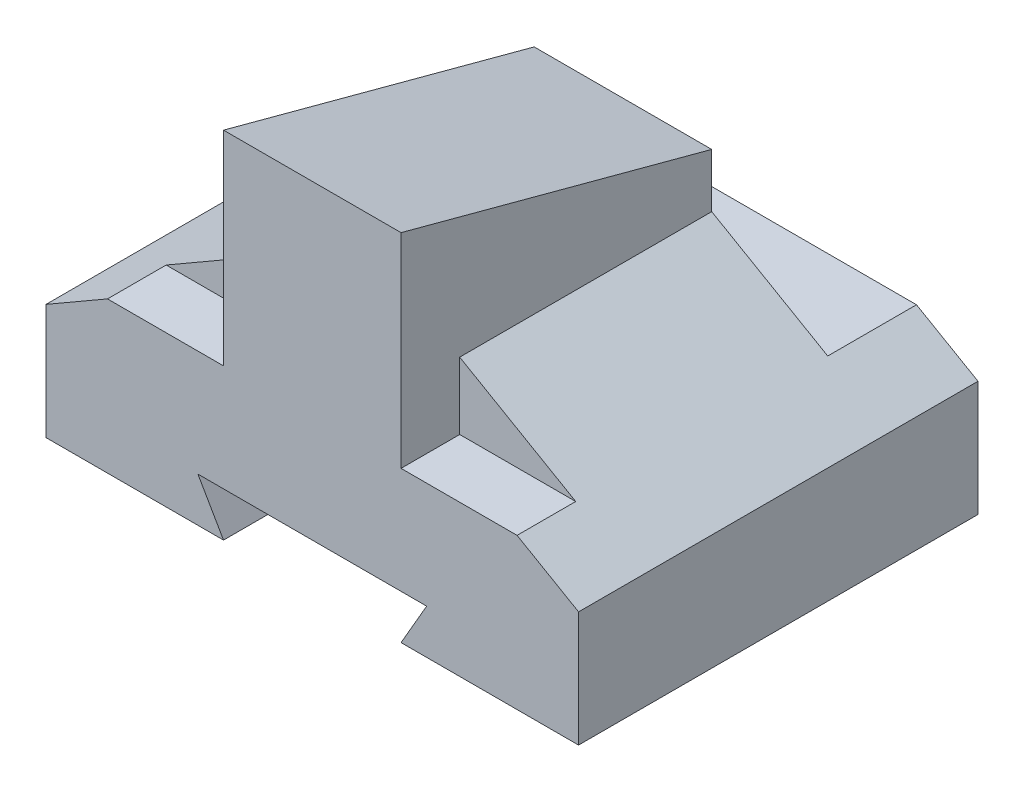
ISO-10303-21;
HEADER;
FILE_DESCRIPTION(('STEP AP214'),'2;1');
FILE_NAME('part.step','',(''),(''),'','','');
FILE_SCHEMA(('AUTOMOTIVE_DESIGN { 1 0 10303 214 1 1 1 1 }'));
ENDSEC;
DATA;
#1=APPLICATION_CONTEXT('core data for automotive mechanical design processes');
#2=APPLICATION_PROTOCOL_DEFINITION('international standard','automotive_design',2000,#1);
#3=PRODUCT_CONTEXT('',#1,'mechanical');
#4=PRODUCT('Part','Part','',(#3));
#5=PRODUCT_RELATED_PRODUCT_CATEGORY('part','',(#4));
#6=PRODUCT_DEFINITION_FORMATION('','',#4);
#7=PRODUCT_DEFINITION_CONTEXT('part definition',#1,'design');
#8=PRODUCT_DEFINITION('design','',#6,#7);
#9=PRODUCT_DEFINITION_SHAPE('','',#8);
#10=(LENGTH_UNIT() NAMED_UNIT(*) SI_UNIT(.MILLI.,.METRE.));
#11=(NAMED_UNIT(*) PLANE_ANGLE_UNIT() SI_UNIT($,.RADIAN.));
#12=(NAMED_UNIT(*) SI_UNIT($,.STERADIAN.) SOLID_ANGLE_UNIT());
#13=UNCERTAINTY_MEASURE_WITH_UNIT(LENGTH_MEASURE(1.E-05),#10,'distance_accuracy_value','');
#14=(GEOMETRIC_REPRESENTATION_CONTEXT(3) GLOBAL_UNCERTAINTY_ASSIGNED_CONTEXT((#13)) GLOBAL_UNIT_ASSIGNED_CONTEXT((#10,
#11,#12)) REPRESENTATION_CONTEXT('',''));
#15=CARTESIAN_POINT('',(0.,0.,0.));
#16=DIRECTION('',(0.,0.,1.));
#17=DIRECTION('',(1.,0.,0.));
#18=AXIS2_PLACEMENT_3D('',#15,#16,#17);
#19=CARTESIAN_POINT('',(30.,13.,22.5));
#20=DIRECTION('',(0.,0.,-1.));
#21=DIRECTION('',(-1.,0.,0.));
#22=AXIS2_PLACEMENT_3D('',#19,#20,#21);
#23=PLANE('',#22);
#24=DIRECTION('',(0.500000000000005,-0.866025403784436,0.));
#25=VECTOR('',#24,1.);
#26=CARTESIAN_POINT('',(-7.49999999999995,-4.33012701892222,22.5));
#27=LINE('',#26,#25);
#28=CARTESIAN_POINT('',(-12.8867513459482,5.,22.5));
#29=VERTEX_POINT('',#28);
#30=CARTESIAN_POINT('',(-9.99999999999999,0.,22.5));
#31=VERTEX_POINT('',#30);
#32=EDGE_CURVE('E482',#29,#31,#27,.T.);
#33=ORIENTED_EDGE('',*,*,#32,.F.);
#34=DIRECTION('',(-1.,0.,0.));
#35=VECTOR('',#34,1.);
#36=CARTESIAN_POINT('',(0.,5.,22.5));
#37=LINE('',#36,#35);
#38=CARTESIAN_POINT('',(12.8867513459481,5.,22.5));
#39=VERTEX_POINT('',#38);
#40=EDGE_CURVE('E476',#39,#29,#37,.T.);
#41=ORIENTED_EDGE('',*,*,#40,.F.);
#42=DIRECTION('',(0.499999999999997,0.86602540378444,0.));
#43=VECTOR('',#42,1.);
#44=CARTESIAN_POINT('',(7.50000000000003,-4.33012701892218,22.5));
#45=LINE('',#44,#43);
#46=CARTESIAN_POINT('',(10.,0.,22.5));
#47=VERTEX_POINT('',#46);
#48=EDGE_CURVE('E471',#47,#39,#45,.T.);
#49=ORIENTED_EDGE('',*,*,#48,.F.);
#50=DIRECTION('',(1.,0.,0.));
#51=VECTOR('',#50,1.);
#52=CARTESIAN_POINT('',(30.,0.,22.5));
#53=LINE('',#52,#51);
#54=CARTESIAN_POINT('',(30.,0.,22.5));
#55=VERTEX_POINT('',#54);
#56=EDGE_CURVE('E255',#47,#55,#53,.T.);
#57=ORIENTED_EDGE('',*,*,#56,.T.);
#58=DIRECTION('',(0.,-1.,0.));
#59=VECTOR('',#58,1.);
#60=CARTESIAN_POINT('',(30.,13.,22.5));
#61=LINE('',#60,#59);
#62=CARTESIAN_POINT('',(30.,13.,22.5));
#63=VERTEX_POINT('',#62);
#64=EDGE_CURVE('E274',#63,#55,#61,.T.);
#65=ORIENTED_EDGE('',*,*,#64,.F.);
#66=DIRECTION('',(0.86602540378444,-0.499999999999998,0.));
#67=VECTOR('',#66,1.);
#68=CARTESIAN_POINT('',(13.1291651245988,22.7403810567666,22.5));
#69=LINE('',#68,#67);
#70=CARTESIAN_POINT('',(23.0717967697244,17.,22.5));
#71=VERTEX_POINT('',#70);
#72=EDGE_CURVE('E228',#71,#63,#69,.T.);
#73=ORIENTED_EDGE('',*,*,#72,.F.);
#74=DIRECTION('',(-1.,0.,0.));
#75=VECTOR('',#74,1.);
#76=CARTESIAN_POINT('',(30.,17.,22.5));
#77=LINE('',#76,#75);
#78=CARTESIAN_POINT('',(10.,17.,22.5));
#79=VERTEX_POINT('',#78);
#80=EDGE_CURVE('E197',#71,#79,#77,.T.);
#81=ORIENTED_EDGE('',*,*,#80,.T.);
#82=DIRECTION('',(0.,1.,0.));
#83=VECTOR('',#82,1.);
#84=CARTESIAN_POINT('',(10.,-0.002000000000002,22.5));
#85=LINE('',#84,#83);
#86=CARTESIAN_POINT('',(10.,40.,22.5));
#87=VERTEX_POINT('',#86);
#88=EDGE_CURVE('E97',#79,#87,#85,.T.);
#89=ORIENTED_EDGE('',*,*,#88,.T.);
#90=DIRECTION('',(-1.,0.,0.));
#91=VECTOR('',#90,1.);
#92=CARTESIAN_POINT('',(-10.,40.,22.5));
#93=LINE('',#92,#91);
#94=CARTESIAN_POINT('',(-10.,40.,22.5));
#95=VERTEX_POINT('',#94);
#96=EDGE_CURVE('E300',#87,#95,#93,.T.);
#97=ORIENTED_EDGE('',*,*,#96,.T.);
#98=DIRECTION('',(0.,1.,0.));
#99=VECTOR('',#98,1.);
#100=CARTESIAN_POINT('',(-10.,-0.002000000000002,22.5));
#101=LINE('',#100,#99);
#102=CARTESIAN_POINT('',(-10.,17.,22.5));
#103=VERTEX_POINT('',#102);
#104=EDGE_CURVE('E316',#103,#95,#101,.T.);
#105=ORIENTED_EDGE('',*,*,#104,.F.);
#106=CARTESIAN_POINT('',(-23.0717967697246,17.,22.5));
#107=VERTEX_POINT('',#106);
#108=EDGE_CURVE('E201',#103,#107,#77,.T.);
#109=ORIENTED_EDGE('',*,*,#108,.T.);
#110=DIRECTION('',(0.866025403784436,0.500000000000004,0.));
#111=VECTOR('',#110,1.);
#112=CARTESIAN_POINT('',(-13.129165124599,22.7403810567666,22.5));
#113=LINE('',#112,#111);
#114=CARTESIAN_POINT('',(-30.,13.,22.5));
#115=VERTEX_POINT('',#114);
#116=EDGE_CURVE('E233',#115,#107,#113,.T.);
#117=ORIENTED_EDGE('',*,*,#116,.F.);
#118=DIRECTION('',(0.,-1.,0.));
#119=VECTOR('',#118,1.);
#120=CARTESIAN_POINT('',(-30.,13.,22.5));
#121=LINE('',#120,#119);
#122=CARTESIAN_POINT('',(-30.,0.,22.5));
#123=VERTEX_POINT('',#122);
#124=EDGE_CURVE('E278',#115,#123,#121,.T.);
#125=ORIENTED_EDGE('',*,*,#124,.T.);
#126=EDGE_CURVE('E256',#123,#31,#53,.T.);
#127=ORIENTED_EDGE('',*,*,#126,.T.);
#128=EDGE_LOOP('',(#33,#41,#49,#57,#65,#73,#81,#89,#97,#105,#109,#117,#125,#127));
#129=FACE_BOUND('',#128,.T.);
#130=ADVANCED_FACE('F44',(#129),#23,.F.);
#131=CARTESIAN_POINT('',(30.,13.,-22.5));
#132=DIRECTION('',(0.,0.,1.));
#133=DIRECTION('',(1.,0.,0.));
#134=AXIS2_PLACEMENT_3D('',#131,#132,#133);
#135=PLANE('',#134);
#136=DIRECTION('',(0.500000000000005,-0.866025403784436,0.));
#137=VECTOR('',#136,1.);
#138=CARTESIAN_POINT('',(-7.49999999999996,-4.33012701892222,-22.5));
#139=LINE('',#138,#137);
#140=CARTESIAN_POINT('',(-12.8867513459482,5.,-22.5));
#141=VERTEX_POINT('',#140);
#142=CARTESIAN_POINT('',(-10.,0.,-22.5));
#143=VERTEX_POINT('',#142);
#144=EDGE_CURVE('E389',#141,#143,#139,.T.);
#145=ORIENTED_EDGE('',*,*,#144,.T.);
#146=DIRECTION('',(-1.,0.,0.));
#147=VECTOR('',#146,1.);
#148=CARTESIAN_POINT('',(30.,0.,-22.5));
#149=LINE('',#148,#147);
#150=CARTESIAN_POINT('',(-30.,0.,-22.5));
#151=VERTEX_POINT('',#150);
#152=EDGE_CURVE('E263',#143,#151,#149,.T.);
#153=ORIENTED_EDGE('',*,*,#152,.T.);
#154=DIRECTION('',(0.,-1.,0.));
#155=VECTOR('',#154,1.);
#156=CARTESIAN_POINT('',(-30.,13.,-22.5));
#157=LINE('',#156,#155);
#158=CARTESIAN_POINT('',(-30.,13.,-22.5));
#159=VERTEX_POINT('',#158);
#160=EDGE_CURVE('E251',#159,#151,#157,.T.);
#161=ORIENTED_EDGE('',*,*,#160,.F.);
#162=DIRECTION('',(0.866025403784436,0.500000000000004,0.));
#163=VECTOR('',#162,1.);
#164=CARTESIAN_POINT('',(-13.129165124599,22.7403810567666,-22.5));
#165=LINE('',#164,#163);
#166=CARTESIAN_POINT('',(-23.0717967697246,17.,-22.5));
#167=VERTEX_POINT('',#166);
#168=EDGE_CURVE('E232',#159,#167,#165,.T.);
#169=ORIENTED_EDGE('',*,*,#168,.T.);
#170=DIRECTION('',(1.,0.,0.));
#171=VECTOR('',#170,1.);
#172=CARTESIAN_POINT('',(-30.,17.,-22.5));
#173=LINE('',#172,#171);
#174=CARTESIAN_POINT('',(23.0717967697244,17.,-22.5));
#175=VERTEX_POINT('',#174);
#176=EDGE_CURVE('E205',#167,#175,#173,.T.);
#177=ORIENTED_EDGE('',*,*,#176,.T.);
#178=DIRECTION('',(0.86602540378444,-0.499999999999998,0.));
#179=VECTOR('',#178,1.);
#180=CARTESIAN_POINT('',(13.1291651245988,22.7403810567666,-22.5));
#181=LINE('',#180,#179);
#182=CARTESIAN_POINT('',(30.,13.,-22.5));
#183=VERTEX_POINT('',#182);
#184=EDGE_CURVE('E229',#175,#183,#181,.T.);
#185=ORIENTED_EDGE('',*,*,#184,.T.);
#186=DIRECTION('',(0.,-1.,0.));
#187=VECTOR('',#186,1.);
#188=CARTESIAN_POINT('',(30.,13.,-22.5));
#189=LINE('',#188,#187);
#190=CARTESIAN_POINT('',(30.,0.,-22.5));
#191=VERTEX_POINT('',#190);
#192=EDGE_CURVE('E270',#183,#191,#189,.T.);
#193=ORIENTED_EDGE('',*,*,#192,.T.);
#194=CARTESIAN_POINT('',(10.,0.,-22.5));
#195=VERTEX_POINT('',#194);
#196=EDGE_CURVE('E247',#191,#195,#149,.T.);
#197=ORIENTED_EDGE('',*,*,#196,.T.);
#198=DIRECTION('',(0.499999999999997,0.86602540378444,0.));
#199=VECTOR('',#198,1.);
#200=CARTESIAN_POINT('',(7.50000000000003,-4.33012701892218,-22.5));
#201=LINE('',#200,#199);
#202=CARTESIAN_POINT('',(12.8867513459481,5.,-22.5));
#203=VERTEX_POINT('',#202);
#204=EDGE_CURVE('E62',#195,#203,#201,.T.);
#205=ORIENTED_EDGE('',*,*,#204,.T.);
#206=DIRECTION('',(-1.,0.,0.));
#207=VECTOR('',#206,1.);
#208=CARTESIAN_POINT('',(0.,5.,-22.5));
#209=LINE('',#208,#207);
#210=EDGE_CURVE('E491',#203,#141,#209,.T.);
#211=ORIENTED_EDGE('',*,*,#210,.T.);
#212=EDGE_LOOP('',(#145,#153,#161,#169,#177,#185,#193,#197,#205,#211));
#213=FACE_BOUND('',#212,.T.);
#214=ADVANCED_FACE('F360',(#213),#135,.F.);
#215=CARTESIAN_POINT('',(0.,0.,0.));
#216=DIRECTION('',(0.,-1.,0.));
#217=DIRECTION('',(0.,0.,-1.));
#218=AXIS2_PLACEMENT_3D('',#215,#216,#217);
#219=PLANE('',#218);
#220=ORIENTED_EDGE('',*,*,#152,.F.);
#221=DIRECTION('',(0.,0.,-1.));
#222=VECTOR('',#221,1.);
#223=CARTESIAN_POINT('',(-9.99999999999999,0.,22.5));
#224=LINE('',#223,#222);
#225=EDGE_CURVE('E304',#31,#143,#224,.T.);
#226=ORIENTED_EDGE('',*,*,#225,.F.);
#227=ORIENTED_EDGE('',*,*,#126,.F.);
#228=DIRECTION('',(0.,0.,1.));
#229=VECTOR('',#228,1.);
#230=CARTESIAN_POINT('',(-30.,0.,-22.5));
#231=LINE('',#230,#229);
#232=EDGE_CURVE('E237',#151,#123,#231,.T.);
#233=ORIENTED_EDGE('',*,*,#232,.F.);
#234=EDGE_LOOP('',(#220,#226,#227,#233));
#235=FACE_BOUND('',#234,.T.);
#236=ADVANCED_FACE('F365',(#235),#219,.T.);
#237=ORIENTED_EDGE('',*,*,#56,.F.);
#238=DIRECTION('',(0.,0.,-1.));
#239=VECTOR('',#238,1.);
#240=CARTESIAN_POINT('',(10.,0.,22.5));
#241=LINE('',#240,#239);
#242=EDGE_CURVE('E310',#47,#195,#241,.T.);
#243=ORIENTED_EDGE('',*,*,#242,.T.);
#244=ORIENTED_EDGE('',*,*,#196,.F.);
#245=DIRECTION('',(0.,0.,-1.));
#246=VECTOR('',#245,1.);
#247=CARTESIAN_POINT('',(30.,0.,-22.5));
#248=LINE('',#247,#246);
#249=EDGE_CURVE('E260',#55,#191,#248,.T.);
#250=ORIENTED_EDGE('',*,*,#249,.F.);
#251=EDGE_LOOP('',(#237,#243,#244,#250));
#252=FACE_BOUND('',#251,.T.);
#253=ADVANCED_FACE('F518',(#252),#219,.T.);
#254=CARTESIAN_POINT('',(13.1291651245988,22.7403810567666,-22.5));
#255=DIRECTION('',(-0.499999999999998,-0.86602540378444,0.));
#256=DIRECTION('',(0.86602540378444,-0.499999999999998,0.));
#257=AXIS2_PLACEMENT_3D('',#254,#255,#256);
#258=PLANE('',#257);
#259=DIRECTION('',(0.,0.,1.));
#260=VECTOR('',#259,1.);
#261=CARTESIAN_POINT('',(10.,24.5470053837924,22.5));
#262=LINE('',#261,#260);
#263=CARTESIAN_POINT('',(10.,24.5470053837924,-12.5));
#264=VERTEX_POINT('',#263);
#265=CARTESIAN_POINT('',(10.,24.5470053837924,15.891891891892));
#266=VERTEX_POINT('',#265);
#267=EDGE_CURVE('E210',#264,#266,#262,.T.);
#268=ORIENTED_EDGE('',*,*,#267,.T.);
#269=DIRECTION('',(-0.86602540378444,0.499999999999998,0.));
#270=VECTOR('',#269,1.);
#271=CARTESIAN_POINT('',(13.1291651245988,22.7403810567666,15.891891891892));
#272=LINE('',#271,#270);
#273=CARTESIAN_POINT('',(23.0717967697244,17.,15.891891891892));
#274=VERTEX_POINT('',#273);
#275=EDGE_CURVE('E224',#274,#266,#272,.T.);
#276=ORIENTED_EDGE('',*,*,#275,.F.);
#277=DIRECTION('',(0.,0.,1.));
#278=VECTOR('',#277,1.);
#279=CARTESIAN_POINT('',(23.0717967697244,17.,-22.5));
#280=LINE('',#279,#278);
#281=EDGE_CURVE('E220',#274,#71,#280,.T.);
#282=ORIENTED_EDGE('',*,*,#281,.T.);
#283=ORIENTED_EDGE('',*,*,#72,.T.);
#284=DIRECTION('',(0.,0.,-1.));
#285=VECTOR('',#284,1.);
#286=CARTESIAN_POINT('',(30.,13.,-22.5));
#287=LINE('',#286,#285);
#288=EDGE_CURVE('E246',#63,#183,#287,.T.);
#289=ORIENTED_EDGE('',*,*,#288,.T.);
#290=ORIENTED_EDGE('',*,*,#184,.F.);
#291=DIRECTION('',(0.,0.,1.));
#292=VECTOR('',#291,1.);
#293=CARTESIAN_POINT('',(23.0717967697244,17.,-22.5));
#294=LINE('',#293,#292);
#295=CARTESIAN_POINT('',(23.0717967697244,17.,-12.5));
#296=VERTEX_POINT('',#295);
#297=EDGE_CURVE('E204',#175,#296,#294,.T.);
#298=ORIENTED_EDGE('',*,*,#297,.T.);
#299=DIRECTION('',(0.86602540378444,-0.499999999999998,0.));
#300=VECTOR('',#299,1.);
#301=CARTESIAN_POINT('',(13.1291651245988,22.7403810567666,-12.5));
#302=LINE('',#301,#300);
#303=EDGE_CURVE('E217',#264,#296,#302,.T.);
#304=ORIENTED_EDGE('',*,*,#303,.F.);
#305=EDGE_LOOP('',(#268,#276,#282,#283,#289,#290,#298,#304));
#306=FACE_BOUND('',#305,.T.);
#307=ADVANCED_FACE('F524',(#306),#258,.F.);
#308=CARTESIAN_POINT('',(-13.129165124599,22.7403810567666,-22.5));
#309=DIRECTION('',(0.500000000000005,-0.866025403784436,0.));
#310=DIRECTION('',(0.866025403784436,0.500000000000005,0.));
#311=AXIS2_PLACEMENT_3D('',#308,#309,#310);
#312=PLANE('',#311);
#313=DIRECTION('',(0.,0.,-1.));
#314=VECTOR('',#313,1.);
#315=CARTESIAN_POINT('',(-10.,24.5470053837927,-12.5));
#316=LINE('',#315,#314);
#317=CARTESIAN_POINT('',(-10.,24.5470053837927,15.891891891892));
#318=VERTEX_POINT('',#317);
#319=CARTESIAN_POINT('',(-10.,24.5470053837927,-12.5));
#320=VERTEX_POINT('',#319);
#321=EDGE_CURVE('E71',#318,#320,#316,.T.);
#322=ORIENTED_EDGE('',*,*,#321,.T.);
#323=DIRECTION('',(0.866025403784436,0.500000000000005,0.));
#324=VECTOR('',#323,1.);
#325=CARTESIAN_POINT('',(-13.129165124599,22.7403810567666,-12.5));
#326=LINE('',#325,#324);
#327=CARTESIAN_POINT('',(-23.0717967697246,17.,-12.5));
#328=VERTEX_POINT('',#327);
#329=EDGE_CURVE('E286',#328,#320,#326,.T.);
#330=ORIENTED_EDGE('',*,*,#329,.F.);
#331=DIRECTION('',(0.,0.,-1.));
#332=VECTOR('',#331,1.);
#333=CARTESIAN_POINT('',(-23.0717967697246,17.,-22.5));
#334=LINE('',#333,#332);
#335=EDGE_CURVE('E282',#328,#167,#334,.T.);
#336=ORIENTED_EDGE('',*,*,#335,.T.);
#337=ORIENTED_EDGE('',*,*,#168,.F.);
#338=DIRECTION('',(0.,0.,1.));
#339=VECTOR('',#338,1.);
#340=CARTESIAN_POINT('',(-30.,13.,-22.5));
#341=LINE('',#340,#339);
#342=EDGE_CURVE('E242',#159,#115,#341,.T.);
#343=ORIENTED_EDGE('',*,*,#342,.T.);
#344=ORIENTED_EDGE('',*,*,#116,.T.);
#345=DIRECTION('',(0.,0.,-1.));
#346=VECTOR('',#345,1.);
#347=CARTESIAN_POINT('',(-23.0717967697246,17.,-22.5));
#348=LINE('',#347,#346);
#349=CARTESIAN_POINT('',(-23.0717967697246,17.,15.891891891892));
#350=VERTEX_POINT('',#349);
#351=EDGE_CURVE('E54',#107,#350,#348,.T.);
#352=ORIENTED_EDGE('',*,*,#351,.T.);
#353=DIRECTION('',(-0.866025403784436,-0.500000000000005,0.));
#354=VECTOR('',#353,1.);
#355=CARTESIAN_POINT('',(-13.129165124599,22.7403810567666,15.891891891892));
#356=LINE('',#355,#354);
#357=EDGE_CURVE('E11',#318,#350,#356,.T.);
#358=ORIENTED_EDGE('',*,*,#357,.F.);
#359=EDGE_LOOP('',(#322,#330,#336,#337,#343,#344,#352,#358));
#360=FACE_BOUND('',#359,.T.);
#361=ADVANCED_FACE('F182',(#360),#312,.F.);
#362=CARTESIAN_POINT('',(30.,17.,15.891891891892));
#363=DIRECTION('',(0.,0.,1.));
#364=DIRECTION('',(1.,0.,0.));
#365=AXIS2_PLACEMENT_3D('',#362,#363,#364);
#366=PLANE('',#365);
#367=DIRECTION('',(1.,0.,0.));
#368=VECTOR('',#367,1.);
#369=CARTESIAN_POINT('',(30.,17.,15.891891891892));
#370=LINE('',#369,#368);
#371=CARTESIAN_POINT('',(-9.99999999999999,17.,15.891891891892));
#372=VERTEX_POINT('',#371);
#373=EDGE_CURVE('E175',#350,#372,#370,.T.);
#374=ORIENTED_EDGE('',*,*,#373,.T.);
#375=DIRECTION('',(0.,-1.,0.));
#376=VECTOR('',#375,1.);
#377=CARTESIAN_POINT('',(-10.,-0.002000000000002,15.891891891892));
#378=LINE('',#377,#376);
#379=EDGE_CURVE('E172',#318,#372,#378,.T.);
#380=ORIENTED_EDGE('',*,*,#379,.F.);
#381=ORIENTED_EDGE('',*,*,#357,.T.);
#382=EDGE_LOOP('',(#374,#380,#381));
#383=FACE_BOUND('',#382,.T.);
#384=ADVANCED_FACE('F173',(#383),#366,.T.);
#385=ORIENTED_EDGE('',*,*,#275,.T.);
#386=DIRECTION('',(0.,1.,0.));
#387=VECTOR('',#386,1.);
#388=CARTESIAN_POINT('',(10.,-0.002000000000002,15.891891891892));
#389=LINE('',#388,#387);
#390=CARTESIAN_POINT('',(10.,17.,15.891891891892));
#391=VERTEX_POINT('',#390);
#392=EDGE_CURVE('E179',#391,#266,#389,.T.);
#393=ORIENTED_EDGE('',*,*,#392,.F.);
#394=EDGE_CURVE('E200',#391,#274,#370,.T.);
#395=ORIENTED_EDGE('',*,*,#394,.T.);
#396=EDGE_LOOP('',(#385,#393,#395));
#397=FACE_BOUND('',#396,.T.);
#398=ADVANCED_FACE('F527',(#397),#366,.T.);
#399=CARTESIAN_POINT('',(0.,17.,0.));
#400=DIRECTION('',(0.,-1.,0.));
#401=DIRECTION('',(0.,0.,-1.));
#402=AXIS2_PLACEMENT_3D('',#399,#400,#401);
#403=PLANE('',#402);
#404=DIRECTION('',(0.,0.,-1.));
#405=VECTOR('',#404,1.);
#406=CARTESIAN_POINT('',(-10.,17.,-12.5));
#407=LINE('',#406,#405);
#408=EDGE_CURVE('E190',#103,#372,#407,.T.);
#409=ORIENTED_EDGE('',*,*,#408,.T.);
#410=ORIENTED_EDGE('',*,*,#373,.F.);
#411=ORIENTED_EDGE('',*,*,#351,.F.);
#412=ORIENTED_EDGE('',*,*,#108,.F.);
#413=EDGE_LOOP('',(#409,#410,#411,#412));
#414=FACE_BOUND('',#413,.T.);
#415=ADVANCED_FACE('F378',(#414),#403,.F.);
#416=DIRECTION('',(0.,0.,1.));
#417=VECTOR('',#416,1.);
#418=CARTESIAN_POINT('',(10.,17.,22.5));
#419=LINE('',#418,#417);
#420=EDGE_CURVE('E194',#391,#79,#419,.T.);
#421=ORIENTED_EDGE('',*,*,#420,.T.);
#422=ORIENTED_EDGE('',*,*,#80,.F.);
#423=ORIENTED_EDGE('',*,*,#281,.F.);
#424=ORIENTED_EDGE('',*,*,#394,.F.);
#425=EDGE_LOOP('',(#421,#422,#423,#424));
#426=FACE_BOUND('',#425,.T.);
#427=ADVANCED_FACE('F334',(#426),#403,.F.);
#428=CARTESIAN_POINT('',(-30.,13.,-22.5));
#429=DIRECTION('',(1.,0.,0.));
#430=DIRECTION('',(0.,0.,-1.));
#431=AXIS2_PLACEMENT_3D('',#428,#429,#430);
#432=PLANE('',#431);
#433=ORIENTED_EDGE('',*,*,#232,.T.);
#434=ORIENTED_EDGE('',*,*,#124,.F.);
#435=ORIENTED_EDGE('',*,*,#342,.F.);
#436=ORIENTED_EDGE('',*,*,#160,.T.);
#437=EDGE_LOOP('',(#433,#434,#435,#436));
#438=FACE_BOUND('',#437,.T.);
#439=ADVANCED_FACE('F370',(#438),#432,.F.);
#440=CARTESIAN_POINT('',(30.,13.,-22.5));
#441=DIRECTION('',(-1.,0.,0.));
#442=DIRECTION('',(0.,0.,1.));
#443=AXIS2_PLACEMENT_3D('',#440,#441,#442);
#444=PLANE('',#443);
#445=ORIENTED_EDGE('',*,*,#249,.T.);
#446=ORIENTED_EDGE('',*,*,#192,.F.);
#447=ORIENTED_EDGE('',*,*,#288,.F.);
#448=ORIENTED_EDGE('',*,*,#64,.T.);
#449=EDGE_LOOP('',(#445,#446,#447,#448));
#450=FACE_BOUND('',#449,.T.);
#451=ADVANCED_FACE('F369',(#450),#444,.F.);
#452=CARTESIAN_POINT('',(30.,17.,-12.5));
#453=DIRECTION('',(0.,0.,-1.));
#454=DIRECTION('',(-1.,0.,0.));
#455=AXIS2_PLACEMENT_3D('',#452,#453,#454);
#456=PLANE('',#455);
#457=DIRECTION('',(0.,1.,0.));
#458=VECTOR('',#457,1.);
#459=CARTESIAN_POINT('',(10.,-0.002000000000002,-12.5));
#460=LINE('',#459,#458);
#461=CARTESIAN_POINT('',(10.,30.6217782649107,-12.5));
#462=VERTEX_POINT('',#461);
#463=EDGE_CURVE('E88',#264,#462,#460,.T.);
#464=ORIENTED_EDGE('',*,*,#463,.F.);
#465=ORIENTED_EDGE('',*,*,#303,.T.);
#466=DIRECTION('',(-1.,0.,0.));
#467=VECTOR('',#466,1.);
#468=CARTESIAN_POINT('',(30.,17.,-12.5));
#469=LINE('',#468,#467);
#470=EDGE_CURVE('E209',#296,#328,#469,.T.);
#471=ORIENTED_EDGE('',*,*,#470,.T.);
#472=ORIENTED_EDGE('',*,*,#329,.T.);
#473=DIRECTION('',(0.,1.,0.));
#474=VECTOR('',#473,1.);
#475=CARTESIAN_POINT('',(-10.,-0.002000000000002,-12.5));
#476=LINE('',#475,#474);
#477=CARTESIAN_POINT('',(-10.,30.6217782649107,-12.5));
#478=VERTEX_POINT('',#477);
#479=EDGE_CURVE('E188',#320,#478,#476,.T.);
#480=ORIENTED_EDGE('',*,*,#479,.T.);
#481=DIRECTION('',(1.,0.,0.));
#482=VECTOR('',#481,1.);
#483=CARTESIAN_POINT('',(30.,30.6217782649107,-12.5));
#484=LINE('',#483,#482);
#485=EDGE_CURVE('E293',#478,#462,#484,.T.);
#486=ORIENTED_EDGE('',*,*,#485,.T.);
#487=EDGE_LOOP('',(#464,#465,#471,#472,#480,#486));
#488=FACE_BOUND('',#487,.T.);
#489=ADVANCED_FACE('F356',(#488),#456,.T.);
#490=CARTESIAN_POINT('',(0.,17.,0.));
#491=DIRECTION('',(0.,-1.,0.));
#492=DIRECTION('',(0.,0.,-1.));
#493=AXIS2_PLACEMENT_3D('',#490,#491,#492);
#494=PLANE('',#493);
#495=ORIENTED_EDGE('',*,*,#176,.F.);
#496=ORIENTED_EDGE('',*,*,#335,.F.);
#497=ORIENTED_EDGE('',*,*,#470,.F.);
#498=ORIENTED_EDGE('',*,*,#297,.F.);
#499=EDGE_LOOP('',(#495,#496,#497,#498));
#500=FACE_BOUND('',#499,.T.);
#501=ADVANCED_FACE('F344',(#500),#494,.F.);
#502=CARTESIAN_POINT('',(-10.,-0.002000000000002,-12.5));
#503=DIRECTION('',(1.,0.,0.));
#504=DIRECTION('',(0.,0.,-1.));
#505=AXIS2_PLACEMENT_3D('',#502,#503,#504);
#506=PLANE('',#505);
#507=ORIENTED_EDGE('',*,*,#321,.F.);
#508=ORIENTED_EDGE('',*,*,#379,.T.);
#509=ORIENTED_EDGE('',*,*,#408,.F.);
#510=ORIENTED_EDGE('',*,*,#104,.T.);
#511=DIRECTION('',(0.,-0.258819045102521,-0.965925826289068));
#512=VECTOR('',#511,1.);
#513=CARTESIAN_POINT('',(-10.,40.,22.5));
#514=LINE('',#513,#512);
#515=EDGE_CURVE('E291',#95,#478,#514,.T.);
#516=ORIENTED_EDGE('',*,*,#515,.T.);
#517=ORIENTED_EDGE('',*,*,#479,.F.);
#518=EDGE_LOOP('',(#507,#508,#509,#510,#516,#517));
#519=FACE_BOUND('',#518,.T.);
#520=ADVANCED_FACE('F186',(#519),#506,.F.);
#521=CARTESIAN_POINT('',(-10.,40.,22.5));
#522=DIRECTION('',(0.,0.965925826289068,-0.258819045102521));
#523=DIRECTION('',(0.,0.258819045102521,0.965925826289068));
#524=AXIS2_PLACEMENT_3D('',#521,#522,#523);
#525=PLANE('',#524);
#526=ORIENTED_EDGE('',*,*,#96,.F.);
#527=DIRECTION('',(0.,0.258819045102521,0.965925826289068));
#528=VECTOR('',#527,1.);
#529=CARTESIAN_POINT('',(10.,40.,22.5));
#530=LINE('',#529,#528);
#531=EDGE_CURVE('E48',#462,#87,#530,.T.);
#532=ORIENTED_EDGE('',*,*,#531,.F.);
#533=ORIENTED_EDGE('',*,*,#485,.F.);
#534=ORIENTED_EDGE('',*,*,#515,.F.);
#535=EDGE_LOOP('',(#526,#532,#533,#534));
#536=FACE_BOUND('',#535,.T.);
#537=ADVANCED_FACE('F46',(#536),#525,.T.);
#538=CARTESIAN_POINT('',(10.,-0.002000000000002,22.5));
#539=DIRECTION('',(-1.,0.,0.));
#540=DIRECTION('',(0.,0.,1.));
#541=AXIS2_PLACEMENT_3D('',#538,#539,#540);
#542=PLANE('',#541);
#543=ORIENTED_EDGE('',*,*,#420,.F.);
#544=ORIENTED_EDGE('',*,*,#392,.T.);
#545=ORIENTED_EDGE('',*,*,#267,.F.);
#546=ORIENTED_EDGE('',*,*,#463,.T.);
#547=ORIENTED_EDGE('',*,*,#531,.T.);
#548=ORIENTED_EDGE('',*,*,#88,.F.);
#549=EDGE_LOOP('',(#543,#544,#545,#546,#547,#548));
#550=FACE_BOUND('',#549,.T.);
#551=ADVANCED_FACE('F340',(#550),#542,.F.);
#552=CARTESIAN_POINT('',(-7.49999999999995,-4.33012701892222,22.5));
#553=DIRECTION('',(0.866025403784436,0.500000000000004,0.));
#554=DIRECTION('',(-0.500000000000005,0.866025403784436,0.));
#555=AXIS2_PLACEMENT_3D('',#552,#553,#554);
#556=PLANE('',#555);
#557=ORIENTED_EDGE('',*,*,#144,.F.);
#558=DIRECTION('',(0.,0.,-1.));
#559=VECTOR('',#558,1.);
#560=CARTESIAN_POINT('',(-12.8867513459482,5.,22.5));
#561=LINE('',#560,#559);
#562=EDGE_CURVE('E314',#29,#141,#561,.T.);
#563=ORIENTED_EDGE('',*,*,#562,.F.);
#564=ORIENTED_EDGE('',*,*,#32,.T.);
#565=ORIENTED_EDGE('',*,*,#225,.T.);
#566=EDGE_LOOP('',(#557,#563,#564,#565));
#567=FACE_BOUND('',#566,.T.);
#568=ADVANCED_FACE('F342',(#567),#556,.T.);
#569=CARTESIAN_POINT('',(7.50000000000003,-4.33012701892218,22.5));
#570=DIRECTION('',(-0.86602540378444,0.499999999999997,0.));
#571=DIRECTION('',(-0.499999999999997,-0.86602540378444,0.));
#572=AXIS2_PLACEMENT_3D('',#569,#570,#571);
#573=PLANE('',#572);
#574=ORIENTED_EDGE('',*,*,#204,.F.);
#575=ORIENTED_EDGE('',*,*,#242,.F.);
#576=ORIENTED_EDGE('',*,*,#48,.T.);
#577=DIRECTION('',(0.,0.,-1.));
#578=VECTOR('',#577,1.);
#579=CARTESIAN_POINT('',(12.8867513459481,5.,22.5));
#580=LINE('',#579,#578);
#581=EDGE_CURVE('E462',#39,#203,#580,.T.);
#582=ORIENTED_EDGE('',*,*,#581,.T.);
#583=EDGE_LOOP('',(#574,#575,#576,#582));
#584=FACE_BOUND('',#583,.T.);
#585=ADVANCED_FACE('F349',(#584),#573,.T.);
#586=CARTESIAN_POINT('',(0.,5.,22.5));
#587=DIRECTION('',(0.,-1.,0.));
#588=DIRECTION('',(0.,0.,-1.));
#589=AXIS2_PLACEMENT_3D('',#586,#587,#588);
#590=PLANE('',#589);
#591=ORIENTED_EDGE('',*,*,#210,.F.);
#592=ORIENTED_EDGE('',*,*,#581,.F.);
#593=ORIENTED_EDGE('',*,*,#40,.T.);
#594=ORIENTED_EDGE('',*,*,#562,.T.);
#595=EDGE_LOOP('',(#591,#592,#593,#594));
#596=FACE_BOUND('',#595,.T.);
#597=ADVANCED_FACE('F506',(#596),#590,.T.);
#598=CLOSED_SHELL('',(#130,#214,#236,#253,#307,#361,#384,#398,#415,#427,#439,#451,#489,#501,
#520,#537,#551,#568,#585,#597));
#599=MANIFOLD_SOLID_BREP('B2',#598);
#600=ADVANCED_BREP_SHAPE_REPRESENTATION('',(#18,#599),#14);
#601=SHAPE_DEFINITION_REPRESENTATION(#9,#600);
ENDSEC;
END-ISO-10303-21;
